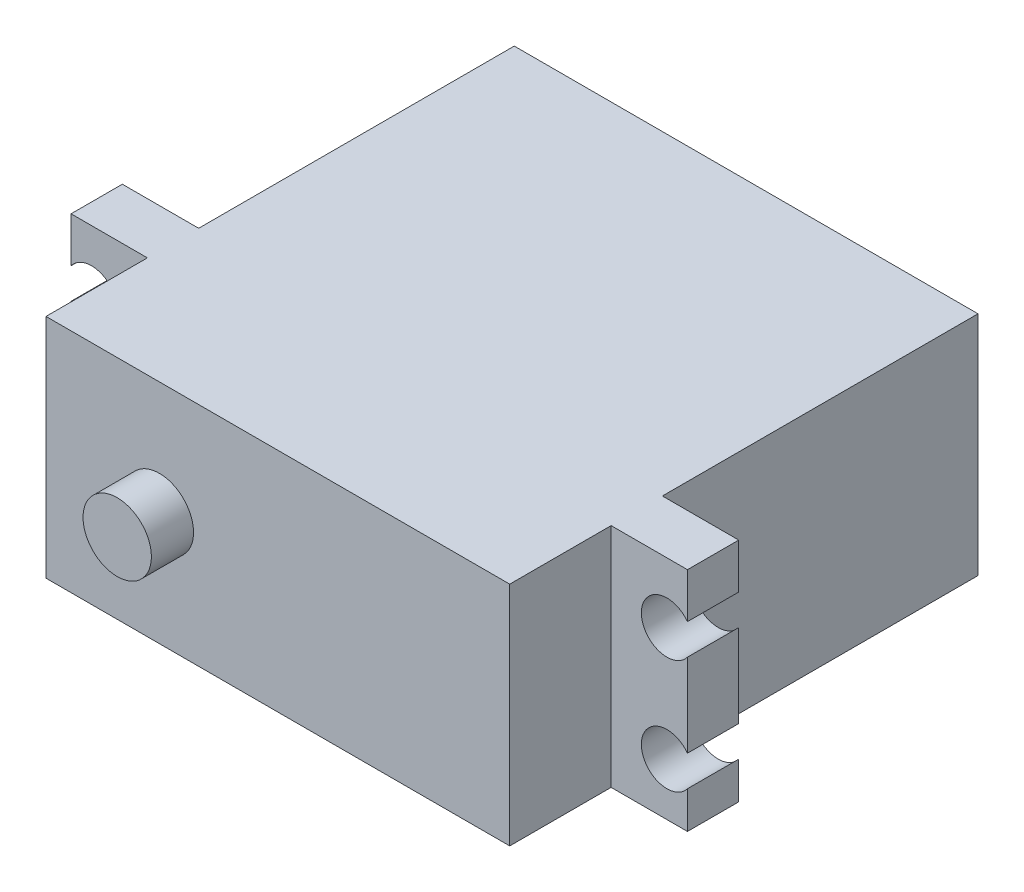
ISO-10303-21;
HEADER;
FILE_DESCRIPTION(('STEP AP214'),'2;1');
FILE_NAME('part.step','',(''),(''),'','','');
FILE_SCHEMA(('AUTOMOTIVE_DESIGN { 1 0 10303 214 1 1 1 1 }'));
ENDSEC;
DATA;
#1=APPLICATION_CONTEXT('core data for automotive mechanical design processes');
#2=APPLICATION_PROTOCOL_DEFINITION('international standard','automotive_design',2000,#1);
#3=PRODUCT_CONTEXT('',#1,'mechanical');
#4=PRODUCT('Part','Part','',(#3));
#5=PRODUCT_RELATED_PRODUCT_CATEGORY('part','',(#4));
#6=PRODUCT_DEFINITION_FORMATION('','',#4);
#7=PRODUCT_DEFINITION_CONTEXT('part definition',#1,'design');
#8=PRODUCT_DEFINITION('design','',#6,#7);
#9=PRODUCT_DEFINITION_SHAPE('','',#8);
#10=(LENGTH_UNIT() NAMED_UNIT(*) SI_UNIT(.MILLI.,.METRE.));
#11=(NAMED_UNIT(*) PLANE_ANGLE_UNIT() SI_UNIT($,.RADIAN.));
#12=(NAMED_UNIT(*) SI_UNIT($,.STERADIAN.) SOLID_ANGLE_UNIT());
#13=UNCERTAINTY_MEASURE_WITH_UNIT(LENGTH_MEASURE(1.E-05),#10,'distance_accuracy_value','');
#14=(GEOMETRIC_REPRESENTATION_CONTEXT(3) GLOBAL_UNCERTAINTY_ASSIGNED_CONTEXT((#13)) GLOBAL_UNIT_ASSIGNED_CONTEXT((#10,
#11,#12)) REPRESENTATION_CONTEXT('',''));
#15=CARTESIAN_POINT('',(0.,0.,0.));
#16=DIRECTION('',(0.,0.,1.));
#17=DIRECTION('',(1.,0.,0.));
#18=AXIS2_PLACEMENT_3D('',#15,#16,#17);
#19=CARTESIAN_POINT('',(-27.05,64.2368308155855,27.7));
#20=DIRECTION('',(-1.,0.,0.));
#21=DIRECTION('',(0.,0.,1.));
#22=AXIS2_PLACEMENT_3D('',#19,#20,#21);
#23=PLANE('',#22);
#24=DIRECTION('',(0.,0.,1.));
#25=VECTOR('',#24,1.);
#26=CARTESIAN_POINT('',(-27.05,-6.70018998686811,-0.001000000000001));
#27=LINE('',#26,#25);
#28=CARTESIAN_POINT('',(-27.05,-6.70018998686811,32.2));
#29=VERTEX_POINT('',#28);
#30=CARTESIAN_POINT('',(-27.05,-6.70018998686811,27.7));
#31=VERTEX_POINT('',#30);
#32=EDGE_CURVE('E63',#29,#31,#27,.F.);
#33=ORIENTED_EDGE('',*,*,#32,.T.);
#34=DIRECTION('',(0.,-1.,0.));
#35=VECTOR('',#34,1.);
#36=CARTESIAN_POINT('',(-27.05,64.2368308155855,27.7));
#37=LINE('',#36,#35);
#38=CARTESIAN_POINT('',(-27.05,-9.95,27.7));
#39=VERTEX_POINT('',#38);
#40=EDGE_CURVE('E345',#31,#39,#37,.T.);
#41=ORIENTED_EDGE('',*,*,#40,.T.);
#42=DIRECTION('',(0.,0.,-1.));
#43=VECTOR('',#42,1.);
#44=CARTESIAN_POINT('',(-27.05,-9.95,27.7));
#45=LINE('',#44,#43);
#46=CARTESIAN_POINT('',(-27.05,-9.95,32.2));
#47=VERTEX_POINT('',#46);
#48=EDGE_CURVE('E314',#47,#39,#45,.T.);
#49=ORIENTED_EDGE('',*,*,#48,.F.);
#50=DIRECTION('',(0.,-1.,0.));
#51=VECTOR('',#50,1.);
#52=CARTESIAN_POINT('',(-27.05,64.2368308155855,32.2));
#53=LINE('',#52,#51);
#54=EDGE_CURVE('E350',#29,#47,#53,.T.);
#55=ORIENTED_EDGE('',*,*,#54,.F.);
#56=EDGE_LOOP('',(#33,#41,#49,#55));
#57=FACE_BOUND('',#56,.T.);
#58=ADVANCED_FACE('F39',(#57),#23,.T.);
#59=DIRECTION('',(0.,0.,1.));
#60=VECTOR('',#59,1.);
#61=CARTESIAN_POINT('',(-27.05,-4.00018998686811,-0.001000000000001));
#62=LINE('',#61,#60);
#63=CARTESIAN_POINT('',(-27.05,-4.00018998686811,27.7));
#64=VERTEX_POINT('',#63);
#65=CARTESIAN_POINT('',(-27.05,-4.00018998686812,32.2));
#66=VERTEX_POINT('',#65);
#67=EDGE_CURVE('E272',#64,#66,#62,.T.);
#68=ORIENTED_EDGE('',*,*,#67,.T.);
#69=CARTESIAN_POINT('',(-27.05,3.29981001313189,32.2));
#70=VERTEX_POINT('',#69);
#71=EDGE_CURVE('E349',#70,#66,#53,.T.);
#72=ORIENTED_EDGE('',*,*,#71,.F.);
#73=DIRECTION('',(0.,0.,1.));
#74=VECTOR('',#73,1.);
#75=CARTESIAN_POINT('',(-27.05,3.29981001313189,-0.001000000000001));
#76=LINE('',#75,#74);
#77=CARTESIAN_POINT('',(-27.05,3.29981001313189,27.7));
#78=VERTEX_POINT('',#77);
#79=EDGE_CURVE('E303',#70,#78,#76,.F.);
#80=ORIENTED_EDGE('',*,*,#79,.T.);
#81=EDGE_CURVE('E367',#78,#64,#37,.T.);
#82=ORIENTED_EDGE('',*,*,#81,.T.);
#83=EDGE_LOOP('',(#68,#72,#80,#82));
#84=FACE_BOUND('',#83,.T.);
#85=ADVANCED_FACE('F527',(#84),#23,.T.);
#86=CARTESIAN_POINT('',(27.05,64.2368308155855,27.7));
#87=DIRECTION('',(1.,0.,0.));
#88=DIRECTION('',(0.,0.,-1.));
#89=AXIS2_PLACEMENT_3D('',#86,#87,#88);
#90=PLANE('',#89);
#91=DIRECTION('',(0.,0.,1.));
#92=VECTOR('',#91,1.);
#93=CARTESIAN_POINT('',(27.05,5.99981001313189,-0.001000000000001));
#94=LINE('',#93,#92);
#95=CARTESIAN_POINT('',(27.05,5.99981001313189,32.2));
#96=VERTEX_POINT('',#95);
#97=CARTESIAN_POINT('',(27.05,5.99981001313189,27.7));
#98=VERTEX_POINT('',#97);
#99=EDGE_CURVE('E290',#96,#98,#94,.F.);
#100=ORIENTED_EDGE('',*,*,#99,.T.);
#101=DIRECTION('',(0.,-1.,0.));
#102=VECTOR('',#101,1.);
#103=CARTESIAN_POINT('',(27.05,64.2368308155855,27.7));
#104=LINE('',#103,#102);
#105=CARTESIAN_POINT('',(27.05,9.95,27.7));
#106=VERTEX_POINT('',#105);
#107=EDGE_CURVE('E357',#106,#98,#104,.T.);
#108=ORIENTED_EDGE('',*,*,#107,.F.);
#109=DIRECTION('',(0.,0.,-1.));
#110=VECTOR('',#109,1.);
#111=CARTESIAN_POINT('',(27.05,9.95,27.7));
#112=LINE('',#111,#110);
#113=CARTESIAN_POINT('',(27.05,9.95,32.2));
#114=VERTEX_POINT('',#113);
#115=EDGE_CURVE('E315',#114,#106,#112,.T.);
#116=ORIENTED_EDGE('',*,*,#115,.F.);
#117=DIRECTION('',(0.,-1.,0.));
#118=VECTOR('',#117,1.);
#119=CARTESIAN_POINT('',(27.05,64.2368308155855,32.2));
#120=LINE('',#119,#118);
#121=EDGE_CURVE('E351',#114,#96,#120,.T.);
#122=ORIENTED_EDGE('',*,*,#121,.T.);
#123=EDGE_LOOP('',(#100,#108,#116,#122));
#124=FACE_BOUND('',#123,.T.);
#125=ADVANCED_FACE('F532',(#124),#90,.T.);
#126=DIRECTION('',(0.,0.,1.));
#127=VECTOR('',#126,1.);
#128=CARTESIAN_POINT('',(27.05,3.29981001313189,-0.001000000000001));
#129=LINE('',#128,#127);
#130=CARTESIAN_POINT('',(27.05,3.29981001313189,27.7));
#131=VERTEX_POINT('',#130);
#132=CARTESIAN_POINT('',(27.05,3.29981001313189,32.2));
#133=VERTEX_POINT('',#132);
#134=EDGE_CURVE('E271',#131,#133,#129,.T.);
#135=ORIENTED_EDGE('',*,*,#134,.T.);
#136=CARTESIAN_POINT('',(27.05,-4.00018998686811,32.2));
#137=VERTEX_POINT('',#136);
#138=EDGE_CURVE('E355',#133,#137,#120,.T.);
#139=ORIENTED_EDGE('',*,*,#138,.T.);
#140=DIRECTION('',(0.,0.,1.));
#141=VECTOR('',#140,1.);
#142=CARTESIAN_POINT('',(27.05,-4.00018998686811,-0.001000000000001));
#143=LINE('',#142,#141);
#144=CARTESIAN_POINT('',(27.05,-4.00018998686812,27.7));
#145=VERTEX_POINT('',#144);
#146=EDGE_CURVE('E260',#137,#145,#143,.F.);
#147=ORIENTED_EDGE('',*,*,#146,.T.);
#148=EDGE_CURVE('E361',#131,#145,#104,.T.);
#149=ORIENTED_EDGE('',*,*,#148,.F.);
#150=EDGE_LOOP('',(#135,#139,#147,#149));
#151=FACE_BOUND('',#150,.T.);
#152=ADVANCED_FACE('F522',(#151),#90,.T.);
#153=CARTESIAN_POINT('',(20.35,-9.95,41.1));
#154=DIRECTION('',(-1.,0.,0.));
#155=DIRECTION('',(0.,0.,1.));
#156=AXIS2_PLACEMENT_3D('',#153,#154,#155);
#157=PLANE('',#156);
#158=DIRECTION('',(0.,0.,-1.));
#159=VECTOR('',#158,1.);
#160=CARTESIAN_POINT('',(20.35,-9.95,41.1));
#161=LINE('',#160,#159);
#162=CARTESIAN_POINT('',(20.35,-9.95,41.1));
#163=VERTEX_POINT('',#162);
#164=CARTESIAN_POINT('',(20.35,-9.95,32.2));
#165=VERTEX_POINT('',#164);
#166=EDGE_CURVE('E416',#163,#165,#161,.T.);
#167=ORIENTED_EDGE('',*,*,#166,.T.);
#168=DIRECTION('',(0.,1.,0.));
#169=VECTOR('',#168,1.);
#170=CARTESIAN_POINT('',(20.35,-9.95,32.2));
#171=LINE('',#170,#169);
#172=CARTESIAN_POINT('',(20.35,9.95,32.2));
#173=VERTEX_POINT('',#172);
#174=EDGE_CURVE('E382',#165,#173,#171,.T.);
#175=ORIENTED_EDGE('',*,*,#174,.T.);
#176=DIRECTION('',(0.,0.,-1.));
#177=VECTOR('',#176,1.);
#178=CARTESIAN_POINT('',(20.35,9.95,41.1));
#179=LINE('',#178,#177);
#180=CARTESIAN_POINT('',(20.35,9.95,41.1));
#181=VERTEX_POINT('',#180);
#182=EDGE_CURVE('E48',#181,#173,#179,.T.);
#183=ORIENTED_EDGE('',*,*,#182,.F.);
#184=DIRECTION('',(0.,1.,0.));
#185=VECTOR('',#184,1.);
#186=CARTESIAN_POINT('',(20.35,-9.95,41.1));
#187=LINE('',#186,#185);
#188=EDGE_CURVE('E387',#163,#181,#187,.T.);
#189=ORIENTED_EDGE('',*,*,#188,.F.);
#190=EDGE_LOOP('',(#167,#175,#183,#189));
#191=FACE_BOUND('',#190,.T.);
#192=ADVANCED_FACE('F490',(#191),#157,.F.);
#193=CARTESIAN_POINT('',(-20.35,-9.95,41.1));
#194=DIRECTION('',(1.,0.,0.));
#195=DIRECTION('',(0.,0.,-1.));
#196=AXIS2_PLACEMENT_3D('',#193,#194,#195);
#197=PLANE('',#196);
#198=DIRECTION('',(0.,0.,-1.));
#199=VECTOR('',#198,1.);
#200=CARTESIAN_POINT('',(-20.35,9.95,41.1));
#201=LINE('',#200,#199);
#202=CARTESIAN_POINT('',(-20.35,9.95,41.1));
#203=VERTEX_POINT('',#202);
#204=CARTESIAN_POINT('',(-20.35,9.95,32.2));
#205=VERTEX_POINT('',#204);
#206=EDGE_CURVE('E426',#203,#205,#201,.T.);
#207=ORIENTED_EDGE('',*,*,#206,.T.);
#208=DIRECTION('',(0.,-1.,0.));
#209=VECTOR('',#208,1.);
#210=CARTESIAN_POINT('',(-20.35,-9.95,32.2));
#211=LINE('',#210,#209);
#212=CARTESIAN_POINT('',(-20.35,-9.95,32.2));
#213=VERTEX_POINT('',#212);
#214=EDGE_CURVE('E379',#205,#213,#211,.T.);
#215=ORIENTED_EDGE('',*,*,#214,.T.);
#216=DIRECTION('',(0.,0.,-1.));
#217=VECTOR('',#216,1.);
#218=CARTESIAN_POINT('',(-20.35,-9.95,41.1));
#219=LINE('',#218,#217);
#220=CARTESIAN_POINT('',(-20.35,-9.95,41.1));
#221=VERTEX_POINT('',#220);
#222=EDGE_CURVE('E421',#221,#213,#219,.T.);
#223=ORIENTED_EDGE('',*,*,#222,.F.);
#224=DIRECTION('',(0.,-1.,0.));
#225=VECTOR('',#224,1.);
#226=CARTESIAN_POINT('',(-20.35,-9.95,41.1));
#227=LINE('',#226,#225);
#228=EDGE_CURVE('E395',#203,#221,#227,.T.);
#229=ORIENTED_EDGE('',*,*,#228,.F.);
#230=EDGE_LOOP('',(#207,#215,#223,#229));
#231=FACE_BOUND('',#230,.T.);
#232=ADVANCED_FACE('F515',(#231),#197,.F.);
#233=CARTESIAN_POINT('',(20.35,9.95,27.7));
#234=VERTEX_POINT('',#233);
#235=CARTESIAN_POINT('',(20.35,9.95,0.));
#236=VERTEX_POINT('',#235);
#237=EDGE_CURVE('E428',#234,#236,#179,.T.);
#238=ORIENTED_EDGE('',*,*,#237,.F.);
#239=DIRECTION('',(0.,-1.,0.));
#240=VECTOR('',#239,1.);
#241=CARTESIAN_POINT('',(20.35,-9.95,27.7));
#242=LINE('',#241,#240);
#243=CARTESIAN_POINT('',(20.35,-9.95,27.7));
#244=VERTEX_POINT('',#243);
#245=EDGE_CURVE('E375',#234,#244,#242,.T.);
#246=ORIENTED_EDGE('',*,*,#245,.T.);
#247=CARTESIAN_POINT('',(20.35,-9.95,0.));
#248=VERTEX_POINT('',#247);
#249=EDGE_CURVE('E401',#244,#248,#161,.T.);
#250=ORIENTED_EDGE('',*,*,#249,.T.);
#251=DIRECTION('',(0.,1.,0.));
#252=VECTOR('',#251,1.);
#253=CARTESIAN_POINT('',(20.35,-9.95,0.));
#254=LINE('',#253,#252);
#255=EDGE_CURVE('E386',#248,#236,#254,.T.);
#256=ORIENTED_EDGE('',*,*,#255,.T.);
#257=EDGE_LOOP('',(#238,#246,#250,#256));
#258=FACE_BOUND('',#257,.T.);
#259=ADVANCED_FACE('F41',(#258),#157,.F.);
#260=CARTESIAN_POINT('',(-20.35,9.95,41.1));
#261=DIRECTION('',(0.,-1.,0.));
#262=DIRECTION('',(0.,0.,-1.));
#263=AXIS2_PLACEMENT_3D('',#260,#261,#262);
#264=PLANE('',#263);
#265=CARTESIAN_POINT('',(-20.35,9.95,27.7));
#266=VERTEX_POINT('',#265);
#267=CARTESIAN_POINT('',(-20.35,9.95,0.));
#268=VERTEX_POINT('',#267);
#269=EDGE_CURVE('E425',#266,#268,#201,.T.);
#270=ORIENTED_EDGE('',*,*,#269,.F.);
#271=DIRECTION('',(-1.,0.,0.));
#272=VECTOR('',#271,1.);
#273=CARTESIAN_POINT('',(-27.05,9.95,27.7));
#274=LINE('',#273,#272);
#275=CARTESIAN_POINT('',(-27.05,9.95,27.7));
#276=VERTEX_POINT('',#275);
#277=EDGE_CURVE('E327',#266,#276,#274,.T.);
#278=ORIENTED_EDGE('',*,*,#277,.T.);
#279=DIRECTION('',(0.,0.,1.));
#280=VECTOR('',#279,1.);
#281=CARTESIAN_POINT('',(-27.05,9.95,27.7));
#282=LINE('',#281,#280);
#283=CARTESIAN_POINT('',(-27.05,9.95,32.2));
#284=VERTEX_POINT('',#283);
#285=EDGE_CURVE('E324',#276,#284,#282,.T.);
#286=ORIENTED_EDGE('',*,*,#285,.T.);
#287=DIRECTION('',(1.,0.,0.));
#288=VECTOR('',#287,1.);
#289=CARTESIAN_POINT('',(-27.05,9.95,32.2));
#290=LINE('',#289,#288);
#291=EDGE_CURVE('E320',#284,#205,#290,.T.);
#292=ORIENTED_EDGE('',*,*,#291,.T.);
#293=ORIENTED_EDGE('',*,*,#206,.F.);
#294=DIRECTION('',(-1.,0.,0.));
#295=VECTOR('',#294,1.);
#296=CARTESIAN_POINT('',(-20.35,9.95,41.1));
#297=LINE('',#296,#295);
#298=EDGE_CURVE('E391',#181,#203,#297,.T.);
#299=ORIENTED_EDGE('',*,*,#298,.F.);
#300=ORIENTED_EDGE('',*,*,#182,.T.);
#301=EDGE_CURVE('E318',#173,#114,#290,.T.);
#302=ORIENTED_EDGE('',*,*,#301,.T.);
#303=ORIENTED_EDGE('',*,*,#115,.T.);
#304=EDGE_CURVE('E368',#106,#234,#274,.T.);
#305=ORIENTED_EDGE('',*,*,#304,.T.);
#306=ORIENTED_EDGE('',*,*,#237,.T.);
#307=DIRECTION('',(-1.,0.,0.));
#308=VECTOR('',#307,1.);
#309=CARTESIAN_POINT('',(-20.35,9.95,0.));
#310=LINE('',#309,#308);
#311=EDGE_CURVE('E405',#236,#268,#310,.T.);
#312=ORIENTED_EDGE('',*,*,#311,.T.);
#313=EDGE_LOOP('',(#270,#278,#286,#292,#293,#299,#300,#302,#303,#305,#306,#312));
#314=FACE_BOUND('',#313,.T.);
#315=ADVANCED_FACE('F436',(#314),#264,.F.);
#316=DIRECTION('',(0.,0.,-1.));
#317=VECTOR('',#316,1.);
#318=CARTESIAN_POINT('',(-20.35,3.35,8.));
#319=LINE('',#318,#317);
#320=CARTESIAN_POINT('',(-20.35,3.35,8.));
#321=VERTEX_POINT('',#320);
#322=CARTESIAN_POINT('',(-20.35,3.35,3.5));
#323=VERTEX_POINT('',#322);
#324=EDGE_CURVE('E229',#321,#323,#319,.T.);
#325=ORIENTED_EDGE('',*,*,#324,.F.);
#326=DIRECTION('',(0.,-1.,0.));
#327=VECTOR('',#326,1.);
#328=CARTESIAN_POINT('',(-20.35,3.35,8.));
#329=LINE('',#328,#327);
#330=CARTESIAN_POINT('',(-20.35,-3.35,8.));
#331=VERTEX_POINT('',#330);
#332=EDGE_CURVE('E238',#321,#331,#329,.T.);
#333=ORIENTED_EDGE('',*,*,#332,.T.);
#334=DIRECTION('',(0.,0.,-1.));
#335=VECTOR('',#334,1.);
#336=CARTESIAN_POINT('',(-20.35,-3.35,8.));
#337=LINE('',#336,#335);
#338=CARTESIAN_POINT('',(-20.35,-3.35,3.5));
#339=VERTEX_POINT('',#338);
#340=EDGE_CURVE('E208',#331,#339,#337,.T.);
#341=ORIENTED_EDGE('',*,*,#340,.T.);
#342=DIRECTION('',(0.,-1.,0.));
#343=VECTOR('',#342,1.);
#344=CARTESIAN_POINT('',(-20.35,3.35,3.5));
#345=LINE('',#344,#343);
#346=EDGE_CURVE('E55',#323,#339,#345,.T.);
#347=ORIENTED_EDGE('',*,*,#346,.F.);
#348=EDGE_LOOP('',(#325,#333,#341,#347));
#349=FACE_BOUND('',#348,.T.);
#350=CARTESIAN_POINT('',(-20.35,-9.95,27.7));
#351=VERTEX_POINT('',#350);
#352=CARTESIAN_POINT('',(-20.35,-9.95,0.));
#353=VERTEX_POINT('',#352);
#354=EDGE_CURVE('E420',#351,#353,#219,.T.);
#355=ORIENTED_EDGE('',*,*,#354,.F.);
#356=DIRECTION('',(0.,1.,0.));
#357=VECTOR('',#356,1.);
#358=CARTESIAN_POINT('',(-20.35,-9.95,27.7));
#359=LINE('',#358,#357);
#360=EDGE_CURVE('E371',#351,#266,#359,.T.);
#361=ORIENTED_EDGE('',*,*,#360,.T.);
#362=ORIENTED_EDGE('',*,*,#269,.T.);
#363=DIRECTION('',(0.,-1.,0.));
#364=VECTOR('',#363,1.);
#365=CARTESIAN_POINT('',(-20.35,-9.95,0.));
#366=LINE('',#365,#364);
#367=EDGE_CURVE('E409',#268,#353,#366,.T.);
#368=ORIENTED_EDGE('',*,*,#367,.T.);
#369=EDGE_LOOP('',(#355,#361,#362,#368));
#370=FACE_BOUND('',#369,.T.);
#371=ADVANCED_FACE('F454',(#349,#370),#197,.F.);
#372=CARTESIAN_POINT('',(-20.35,-9.95,41.1));
#373=DIRECTION('',(0.,1.,0.));
#374=DIRECTION('',(0.,0.,1.));
#375=AXIS2_PLACEMENT_3D('',#372,#373,#374);
#376=PLANE('',#375);
#377=ORIENTED_EDGE('',*,*,#249,.F.);
#378=DIRECTION('',(1.,0.,0.));
#379=VECTOR('',#378,1.);
#380=CARTESIAN_POINT('',(-27.05,-9.95,27.7));
#381=LINE('',#380,#379);
#382=CARTESIAN_POINT('',(27.05,-9.95,27.7));
#383=VERTEX_POINT('',#382);
#384=EDGE_CURVE('E331',#244,#383,#381,.T.);
#385=ORIENTED_EDGE('',*,*,#384,.T.);
#386=DIRECTION('',(0.,0.,1.));
#387=VECTOR('',#386,1.);
#388=CARTESIAN_POINT('',(27.05,-9.95,27.7));
#389=LINE('',#388,#387);
#390=CARTESIAN_POINT('',(27.05,-9.95,32.2));
#391=VERTEX_POINT('',#390);
#392=EDGE_CURVE('E336',#383,#391,#389,.T.);
#393=ORIENTED_EDGE('',*,*,#392,.T.);
#394=DIRECTION('',(-1.,0.,0.));
#395=VECTOR('',#394,1.);
#396=CARTESIAN_POINT('',(-27.05,-9.95,32.2));
#397=LINE('',#396,#395);
#398=EDGE_CURVE('E341',#391,#165,#397,.T.);
#399=ORIENTED_EDGE('',*,*,#398,.T.);
#400=ORIENTED_EDGE('',*,*,#166,.F.);
#401=DIRECTION('',(1.,0.,0.));
#402=VECTOR('',#401,1.);
#403=CARTESIAN_POINT('',(-20.35,-9.95,41.1));
#404=LINE('',#403,#402);
#405=EDGE_CURVE('E398',#221,#163,#404,.T.);
#406=ORIENTED_EDGE('',*,*,#405,.F.);
#407=ORIENTED_EDGE('',*,*,#222,.T.);
#408=EDGE_CURVE('E340',#213,#47,#397,.T.);
#409=ORIENTED_EDGE('',*,*,#408,.T.);
#410=ORIENTED_EDGE('',*,*,#48,.T.);
#411=EDGE_CURVE('E332',#39,#351,#381,.T.);
#412=ORIENTED_EDGE('',*,*,#411,.T.);
#413=ORIENTED_EDGE('',*,*,#354,.T.);
#414=DIRECTION('',(1.,0.,0.));
#415=VECTOR('',#414,1.);
#416=CARTESIAN_POINT('',(-20.35,-9.95,0.));
#417=LINE('',#416,#415);
#418=EDGE_CURVE('E392',#353,#248,#417,.T.);
#419=ORIENTED_EDGE('',*,*,#418,.T.);
#420=EDGE_LOOP('',(#377,#385,#393,#399,#400,#406,#407,#409,#410,#412,#413,#419));
#421=FACE_BOUND('',#420,.T.);
#422=ADVANCED_FACE('F449',(#421),#376,.F.);
#423=CARTESIAN_POINT('',(0.,0.,41.1));
#424=DIRECTION('',(0.,0.,-1.));
#425=DIRECTION('',(-1.,0.,0.));
#426=AXIS2_PLACEMENT_3D('',#423,#424,#425);
#427=PLANE('',#426);
#428=CARTESIAN_POINT('',(-10.4,0.,41.1));
#429=DIRECTION('',(0.,0.,-1.));
#430=DIRECTION('',(-1.,0.,0.));
#431=AXIS2_PLACEMENT_3D('',#428,#429,#430);
#432=CIRCLE('',#431,3.);
#433=CARTESIAN_POINT('',(-13.4,0.,41.1));
#434=VERTEX_POINT('',#433);
#435=EDGE_CURVE('E11',#434,#434,#432,.F.);
#436=ORIENTED_EDGE('',*,*,#435,.F.);
#437=EDGE_LOOP('',(#436));
#438=FACE_BOUND('',#437,.T.);
#439=ORIENTED_EDGE('',*,*,#188,.T.);
#440=ORIENTED_EDGE('',*,*,#298,.T.);
#441=ORIENTED_EDGE('',*,*,#228,.T.);
#442=ORIENTED_EDGE('',*,*,#405,.T.);
#443=EDGE_LOOP('',(#439,#440,#441,#442));
#444=FACE_BOUND('',#443,.T.);
#445=ADVANCED_FACE('F492',(#438,#444),#427,.F.);
#446=CARTESIAN_POINT('',(0.,0.,0.));
#447=DIRECTION('',(0.,0.,-1.));
#448=DIRECTION('',(-1.,0.,0.));
#449=AXIS2_PLACEMENT_3D('',#446,#447,#448);
#450=PLANE('',#449);
#451=ORIENTED_EDGE('',*,*,#255,.F.);
#452=ORIENTED_EDGE('',*,*,#418,.F.);
#453=ORIENTED_EDGE('',*,*,#367,.F.);
#454=ORIENTED_EDGE('',*,*,#311,.F.);
#455=EDGE_LOOP('',(#451,#452,#453,#454));
#456=FACE_BOUND('',#455,.T.);
#457=ADVANCED_FACE('F443',(#456),#450,.T.);
#458=DIRECTION('',(0.,0.,1.));
#459=VECTOR('',#458,1.);
#460=CARTESIAN_POINT('',(-27.05,5.99981001313189,-0.001000000000001));
#461=LINE('',#460,#459);
#462=CARTESIAN_POINT('',(-27.05,5.99981001313189,27.7));
#463=VERTEX_POINT('',#462);
#464=CARTESIAN_POINT('',(-27.05,5.99981001313189,32.2));
#465=VERTEX_POINT('',#464);
#466=EDGE_CURVE('E286',#463,#465,#461,.T.);
#467=ORIENTED_EDGE('',*,*,#466,.T.);
#468=EDGE_CURVE('E319',#284,#465,#53,.T.);
#469=ORIENTED_EDGE('',*,*,#468,.F.);
#470=ORIENTED_EDGE('',*,*,#285,.F.);
#471=EDGE_CURVE('E363',#276,#463,#37,.T.);
#472=ORIENTED_EDGE('',*,*,#471,.T.);
#473=EDGE_LOOP('',(#467,#469,#470,#472));
#474=FACE_BOUND('',#473,.T.);
#475=ADVANCED_FACE('F512',(#474),#23,.T.);
#476=CARTESIAN_POINT('',(-27.05,64.2368308155855,27.7));
#477=DIRECTION('',(0.,0.,-1.));
#478=DIRECTION('',(-1.,0.,0.));
#479=AXIS2_PLACEMENT_3D('',#476,#477,#478);
#480=PLANE('',#479);
#481=CARTESIAN_POINT('',(-25.25,-5.35018998686811,27.7));
#482=DIRECTION('',(0.,0.,-1.));
#483=DIRECTION('',(-1.,0.,0.));
#484=AXIS2_PLACEMENT_3D('',#481,#482,#483);
#485=CIRCLE('',#484,2.25);
#486=EDGE_CURVE('E282',#31,#64,#485,.F.);
#487=ORIENTED_EDGE('',*,*,#486,.T.);
#488=ORIENTED_EDGE('',*,*,#81,.F.);
#489=CARTESIAN_POINT('',(-25.25,4.64981001313189,27.7));
#490=DIRECTION('',(0.,0.,-1.));
#491=DIRECTION('',(-1.,0.,0.));
#492=AXIS2_PLACEMENT_3D('',#489,#490,#491);
#493=CIRCLE('',#492,2.25);
#494=EDGE_CURVE('E310',#78,#463,#493,.F.);
#495=ORIENTED_EDGE('',*,*,#494,.T.);
#496=ORIENTED_EDGE('',*,*,#471,.F.);
#497=ORIENTED_EDGE('',*,*,#277,.F.);
#498=ORIENTED_EDGE('',*,*,#360,.F.);
#499=ORIENTED_EDGE('',*,*,#411,.F.);
#500=ORIENTED_EDGE('',*,*,#40,.F.);
#501=EDGE_LOOP('',(#487,#488,#495,#496,#497,#498,#499,#500));
#502=FACE_BOUND('',#501,.T.);
#503=ADVANCED_FACE('F507',(#502),#480,.T.);
#504=CARTESIAN_POINT('',(-27.05,64.2368308155855,32.2));
#505=DIRECTION('',(0.,0.,1.));
#506=DIRECTION('',(1.,0.,0.));
#507=AXIS2_PLACEMENT_3D('',#504,#505,#506);
#508=PLANE('',#507);
#509=CARTESIAN_POINT('',(-25.25,-5.35018998686811,32.2));
#510=DIRECTION('',(0.,0.,1.));
#511=DIRECTION('',(1.,0.,0.));
#512=AXIS2_PLACEMENT_3D('',#509,#510,#511);
#513=CIRCLE('',#512,2.25);
#514=EDGE_CURVE('E279',#29,#66,#513,.T.);
#515=ORIENTED_EDGE('',*,*,#514,.F.);
#516=ORIENTED_EDGE('',*,*,#54,.T.);
#517=ORIENTED_EDGE('',*,*,#408,.F.);
#518=ORIENTED_EDGE('',*,*,#214,.F.);
#519=ORIENTED_EDGE('',*,*,#291,.F.);
#520=ORIENTED_EDGE('',*,*,#468,.T.);
#521=CARTESIAN_POINT('',(-25.25,4.64981001313189,32.2));
#522=DIRECTION('',(0.,0.,1.));
#523=DIRECTION('',(1.,0.,0.));
#524=AXIS2_PLACEMENT_3D('',#521,#522,#523);
#525=CIRCLE('',#524,2.25);
#526=EDGE_CURVE('E307',#70,#465,#525,.T.);
#527=ORIENTED_EDGE('',*,*,#526,.F.);
#528=ORIENTED_EDGE('',*,*,#71,.T.);
#529=EDGE_LOOP('',(#515,#516,#517,#518,#519,#520,#527,#528));
#530=FACE_BOUND('',#529,.T.);
#531=ADVANCED_FACE('F501',(#530),#508,.T.);
#532=CARTESIAN_POINT('',(25.25,4.64981001313189,32.2));
#533=DIRECTION('',(0.,0.,1.));
#534=DIRECTION('',(1.,0.,0.));
#535=AXIS2_PLACEMENT_3D('',#532,#533,#534);
#536=CIRCLE('',#535,2.25);
#537=EDGE_CURVE('E294',#96,#133,#536,.T.);
#538=ORIENTED_EDGE('',*,*,#537,.F.);
#539=ORIENTED_EDGE('',*,*,#121,.F.);
#540=ORIENTED_EDGE('',*,*,#301,.F.);
#541=ORIENTED_EDGE('',*,*,#174,.F.);
#542=ORIENTED_EDGE('',*,*,#398,.F.);
#543=CARTESIAN_POINT('',(27.05,-6.70018998686811,32.2));
#544=VERTEX_POINT('',#543);
#545=EDGE_CURVE('E356',#544,#391,#120,.T.);
#546=ORIENTED_EDGE('',*,*,#545,.F.);
#547=CARTESIAN_POINT('',(25.25,-5.35018998686811,32.2));
#548=DIRECTION('',(0.,0.,1.));
#549=DIRECTION('',(1.,0.,0.));
#550=AXIS2_PLACEMENT_3D('',#547,#548,#549);
#551=CIRCLE('',#550,2.25);
#552=EDGE_CURVE('E264',#137,#544,#551,.T.);
#553=ORIENTED_EDGE('',*,*,#552,.F.);
#554=ORIENTED_EDGE('',*,*,#138,.F.);
#555=EDGE_LOOP('',(#538,#539,#540,#541,#542,#546,#553,#554));
#556=FACE_BOUND('',#555,.T.);
#557=ADVANCED_FACE('F484',(#556),#508,.T.);
#558=CARTESIAN_POINT('',(25.25,4.64981001313189,27.7));
#559=DIRECTION('',(0.,0.,-1.));
#560=DIRECTION('',(-1.,0.,0.));
#561=AXIS2_PLACEMENT_3D('',#558,#559,#560);
#562=CIRCLE('',#561,2.25);
#563=EDGE_CURVE('E276',#98,#131,#562,.F.);
#564=ORIENTED_EDGE('',*,*,#563,.T.);
#565=ORIENTED_EDGE('',*,*,#148,.T.);
#566=CARTESIAN_POINT('',(25.25,-5.35018998686811,27.7));
#567=DIRECTION('',(0.,0.,-1.));
#568=DIRECTION('',(-1.,0.,0.));
#569=AXIS2_PLACEMENT_3D('',#566,#567,#568);
#570=CIRCLE('',#569,2.25);
#571=CARTESIAN_POINT('',(27.05,-6.70018998686811,27.7));
#572=VERTEX_POINT('',#571);
#573=EDGE_CURVE('E267',#145,#572,#570,.F.);
#574=ORIENTED_EDGE('',*,*,#573,.T.);
#575=EDGE_CURVE('E362',#572,#383,#104,.T.);
#576=ORIENTED_EDGE('',*,*,#575,.T.);
#577=ORIENTED_EDGE('',*,*,#384,.F.);
#578=ORIENTED_EDGE('',*,*,#245,.F.);
#579=ORIENTED_EDGE('',*,*,#304,.F.);
#580=ORIENTED_EDGE('',*,*,#107,.T.);
#581=EDGE_LOOP('',(#564,#565,#574,#576,#577,#578,#579,#580));
#582=FACE_BOUND('',#581,.T.);
#583=ADVANCED_FACE('F541',(#582),#480,.T.);
#584=DIRECTION('',(0.,0.,1.));
#585=VECTOR('',#584,1.);
#586=CARTESIAN_POINT('',(27.05,-6.70018998686812,-0.001000000000001));
#587=LINE('',#586,#585);
#588=EDGE_CURVE('E256',#572,#544,#587,.T.);
#589=ORIENTED_EDGE('',*,*,#588,.T.);
#590=ORIENTED_EDGE('',*,*,#545,.T.);
#591=ORIENTED_EDGE('',*,*,#392,.F.);
#592=ORIENTED_EDGE('',*,*,#575,.F.);
#593=EDGE_LOOP('',(#589,#590,#591,#592));
#594=FACE_BOUND('',#593,.T.);
#595=ADVANCED_FACE('F479',(#594),#90,.T.);
#596=CARTESIAN_POINT('',(25.25,-5.35018998686811,-0.001000000000001));
#597=DIRECTION('',(0.,0.,1.));
#598=DIRECTION('',(1.,0.,0.));
#599=AXIS2_PLACEMENT_3D('',#596,#597,#598);
#600=CYLINDRICAL_SURFACE('',#599,2.25);
#601=ORIENTED_EDGE('',*,*,#552,.T.);
#602=ORIENTED_EDGE('',*,*,#588,.F.);
#603=ORIENTED_EDGE('',*,*,#573,.F.);
#604=ORIENTED_EDGE('',*,*,#146,.F.);
#605=EDGE_LOOP('',(#601,#602,#603,#604));
#606=FACE_BOUND('',#605,.T.);
#607=ADVANCED_FACE('F636',(#606),#600,.F.);
#608=CARTESIAN_POINT('',(25.25,4.64981001313189,-0.001000000000001));
#609=DIRECTION('',(0.,0.,1.));
#610=DIRECTION('',(1.,0.,0.));
#611=AXIS2_PLACEMENT_3D('',#608,#609,#610);
#612=CYLINDRICAL_SURFACE('',#611,2.25);
#613=ORIENTED_EDGE('',*,*,#537,.T.);
#614=ORIENTED_EDGE('',*,*,#134,.F.);
#615=ORIENTED_EDGE('',*,*,#563,.F.);
#616=ORIENTED_EDGE('',*,*,#99,.F.);
#617=EDGE_LOOP('',(#613,#614,#615,#616));
#618=FACE_BOUND('',#617,.T.);
#619=ADVANCED_FACE('F639',(#618),#612,.F.);
#620=CARTESIAN_POINT('',(-25.25,4.64981001313189,-0.001000000000001));
#621=DIRECTION('',(0.,0.,1.));
#622=DIRECTION('',(1.,0.,0.));
#623=AXIS2_PLACEMENT_3D('',#620,#621,#622);
#624=CYLINDRICAL_SURFACE('',#623,2.25);
#625=ORIENTED_EDGE('',*,*,#526,.T.);
#626=ORIENTED_EDGE('',*,*,#466,.F.);
#627=ORIENTED_EDGE('',*,*,#494,.F.);
#628=ORIENTED_EDGE('',*,*,#79,.F.);
#629=EDGE_LOOP('',(#625,#626,#627,#628));
#630=FACE_BOUND('',#629,.T.);
#631=ADVANCED_FACE('F642',(#630),#624,.F.);
#632=CARTESIAN_POINT('',(-25.25,-5.35018998686811,-0.001000000000001));
#633=DIRECTION('',(0.,0.,1.));
#634=DIRECTION('',(1.,0.,0.));
#635=AXIS2_PLACEMENT_3D('',#632,#633,#634);
#636=CYLINDRICAL_SURFACE('',#635,2.25);
#637=ORIENTED_EDGE('',*,*,#514,.T.);
#638=ORIENTED_EDGE('',*,*,#67,.F.);
#639=ORIENTED_EDGE('',*,*,#486,.F.);
#640=ORIENTED_EDGE('',*,*,#32,.F.);
#641=EDGE_LOOP('',(#637,#638,#639,#640));
#642=FACE_BOUND('',#641,.T.);
#643=ADVANCED_FACE('F567',(#642),#636,.F.);
#644=CARTESIAN_POINT('',(-10.4,0.,44.8));
#645=DIRECTION('',(0.,0.,-1.));
#646=DIRECTION('',(-1.,0.,0.));
#647=AXIS2_PLACEMENT_3D('',#644,#645,#646);
#648=CYLINDRICAL_SURFACE('',#647,3.);
#649=CARTESIAN_POINT('',(-10.4,0.,44.8));
#650=DIRECTION('',(0.,0.,1.));
#651=DIRECTION('',(1.,0.,0.));
#652=AXIS2_PLACEMENT_3D('',#649,#650,#651);
#653=CIRCLE('',#652,3.);
#654=CARTESIAN_POINT('',(-7.4,0.,44.8));
#655=VERTEX_POINT('',#654);
#656=EDGE_CURVE('E247',#655,#655,#653,.T.);
#657=ORIENTED_EDGE('',*,*,#656,.F.);
#658=EDGE_LOOP('',(#657));
#659=FACE_BOUND('',#658,.T.);
#660=ORIENTED_EDGE('',*,*,#435,.T.);
#661=EDGE_LOOP('',(#660));
#662=FACE_BOUND('',#661,.T.);
#663=ADVANCED_FACE('F572',(#659,#662),#648,.T.);
#664=CARTESIAN_POINT('',(-10.4,0.,44.8));
#665=DIRECTION('',(0.,0.,1.));
#666=DIRECTION('',(1.,0.,0.));
#667=AXIS2_PLACEMENT_3D('',#664,#665,#666);
#668=PLANE('',#667);
#669=ORIENTED_EDGE('',*,*,#656,.T.);
#670=EDGE_LOOP('',(#669));
#671=FACE_BOUND('',#670,.T.);
#672=ADVANCED_FACE('F577',(#671),#668,.T.);
#673=CARTESIAN_POINT('',(-25.85,3.35,8.));
#674=DIRECTION('',(0.,0.,1.));
#675=DIRECTION('',(0.,-1.,0.));
#676=AXIS2_PLACEMENT_3D('',#673,#674,#675);
#677=PLANE('',#676);
#678=ORIENTED_EDGE('',*,*,#332,.F.);
#679=DIRECTION('',(1.,0.,0.));
#680=VECTOR('',#679,1.);
#681=CARTESIAN_POINT('',(-25.85,3.35,8.));
#682=LINE('',#681,#680);
#683=CARTESIAN_POINT('',(-25.85,3.35,8.));
#684=VERTEX_POINT('',#683);
#685=EDGE_CURVE('E226',#684,#321,#682,.T.);
#686=ORIENTED_EDGE('',*,*,#685,.F.);
#687=DIRECTION('',(0.,-1.,0.));
#688=VECTOR('',#687,1.);
#689=CARTESIAN_POINT('',(-25.85,3.35,8.));
#690=LINE('',#689,#688);
#691=CARTESIAN_POINT('',(-25.85,-3.35,8.));
#692=VERTEX_POINT('',#691);
#693=EDGE_CURVE('E220',#684,#692,#690,.T.);
#694=ORIENTED_EDGE('',*,*,#693,.T.);
#695=DIRECTION('',(1.,0.,0.));
#696=VECTOR('',#695,1.);
#697=CARTESIAN_POINT('',(-25.85,-3.35,8.));
#698=LINE('',#697,#696);
#699=EDGE_CURVE('E203',#692,#331,#698,.T.);
#700=ORIENTED_EDGE('',*,*,#699,.T.);
#701=EDGE_LOOP('',(#678,#686,#694,#700));
#702=FACE_BOUND('',#701,.T.);
#703=ADVANCED_FACE('F225',(#702),#677,.T.);
#704=CARTESIAN_POINT('',(-25.85,3.35,8.));
#705=DIRECTION('',(0.,-1.,0.));
#706=DIRECTION('',(0.,0.,-1.));
#707=AXIS2_PLACEMENT_3D('',#704,#705,#706);
#708=PLANE('',#707);
#709=ORIENTED_EDGE('',*,*,#324,.T.);
#710=DIRECTION('',(1.,0.,0.));
#711=VECTOR('',#710,1.);
#712=CARTESIAN_POINT('',(-25.85,3.35,3.5));
#713=LINE('',#712,#711);
#714=CARTESIAN_POINT('',(-25.85,3.35,3.5));
#715=VERTEX_POINT('',#714);
#716=EDGE_CURVE('E248',#715,#323,#713,.T.);
#717=ORIENTED_EDGE('',*,*,#716,.F.);
#718=DIRECTION('',(0.,0.,-1.));
#719=VECTOR('',#718,1.);
#720=CARTESIAN_POINT('',(-25.85,3.35,8.));
#721=LINE('',#720,#719);
#722=EDGE_CURVE('E215',#684,#715,#721,.T.);
#723=ORIENTED_EDGE('',*,*,#722,.F.);
#724=ORIENTED_EDGE('',*,*,#685,.T.);
#725=EDGE_LOOP('',(#709,#717,#723,#724));
#726=FACE_BOUND('',#725,.T.);
#727=ADVANCED_FACE('F597',(#726),#708,.F.);
#728=CARTESIAN_POINT('',(-25.85,3.35,3.5));
#729=DIRECTION('',(0.,0.,1.));
#730=DIRECTION('',(0.,-1.,0.));
#731=AXIS2_PLACEMENT_3D('',#728,#729,#730);
#732=PLANE('',#731);
#733=ORIENTED_EDGE('',*,*,#346,.T.);
#734=DIRECTION('',(1.,0.,0.));
#735=VECTOR('',#734,1.);
#736=CARTESIAN_POINT('',(-25.85,-3.35,3.5));
#737=LINE('',#736,#735);
#738=CARTESIAN_POINT('',(-25.85,-3.35,3.5));
#739=VERTEX_POINT('',#738);
#740=EDGE_CURVE('E214',#739,#339,#737,.T.);
#741=ORIENTED_EDGE('',*,*,#740,.F.);
#742=DIRECTION('',(0.,-1.,0.));
#743=VECTOR('',#742,1.);
#744=CARTESIAN_POINT('',(-25.85,3.35,3.5));
#745=LINE('',#744,#743);
#746=EDGE_CURVE('E222',#715,#739,#745,.T.);
#747=ORIENTED_EDGE('',*,*,#746,.F.);
#748=ORIENTED_EDGE('',*,*,#716,.T.);
#749=EDGE_LOOP('',(#733,#741,#747,#748));
#750=FACE_BOUND('',#749,.T.);
#751=ADVANCED_FACE('F606',(#750),#732,.F.);
#752=CARTESIAN_POINT('',(-25.85,-3.35,8.));
#753=DIRECTION('',(0.,-1.,0.));
#754=DIRECTION('',(0.,0.,-1.));
#755=AXIS2_PLACEMENT_3D('',#752,#753,#754);
#756=PLANE('',#755);
#757=ORIENTED_EDGE('',*,*,#340,.F.);
#758=ORIENTED_EDGE('',*,*,#699,.F.);
#759=DIRECTION('',(0.,0.,-1.));
#760=VECTOR('',#759,1.);
#761=CARTESIAN_POINT('',(-25.85,-3.35,8.));
#762=LINE('',#761,#760);
#763=EDGE_CURVE('E206',#692,#739,#762,.T.);
#764=ORIENTED_EDGE('',*,*,#763,.T.);
#765=ORIENTED_EDGE('',*,*,#740,.T.);
#766=EDGE_LOOP('',(#757,#758,#764,#765));
#767=FACE_BOUND('',#766,.T.);
#768=ADVANCED_FACE('F205',(#767),#756,.T.);
#769=CARTESIAN_POINT('',(-25.85,0.,0.));
#770=DIRECTION('',(1.,0.,0.));
#771=DIRECTION('',(0.,0.,-1.));
#772=AXIS2_PLACEMENT_3D('',#769,#770,#771);
#773=PLANE('',#772);
#774=ORIENTED_EDGE('',*,*,#693,.F.);
#775=ORIENTED_EDGE('',*,*,#722,.T.);
#776=ORIENTED_EDGE('',*,*,#746,.T.);
#777=ORIENTED_EDGE('',*,*,#763,.F.);
#778=EDGE_LOOP('',(#774,#775,#776,#777));
#779=FACE_BOUND('',#778,.T.);
#780=ADVANCED_FACE('F219',(#779),#773,.F.);
#781=CLOSED_SHELL('',(#58,#85,#125,#152,#192,#232,#259,#315,#371,#422,#445,#457,#475,#503,#531,
#557,#583,#595,#607,#619,#631,#643,#663,#672,#703,#727,#751,#768,#780));
#782=MANIFOLD_SOLID_BREP('B2',#781);
#783=ADVANCED_BREP_SHAPE_REPRESENTATION('',(#18,#782),#14);
#784=SHAPE_DEFINITION_REPRESENTATION(#9,#783);
ENDSEC;
END-ISO-10303-21;
